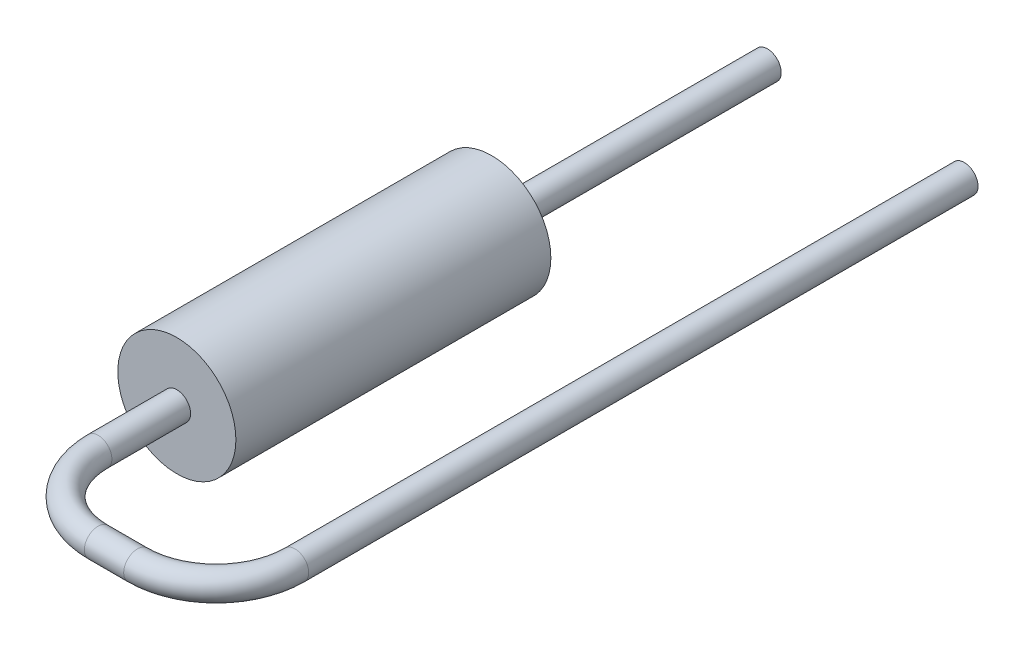
ISO-10303-21;
HEADER;
FILE_DESCRIPTION(('STEP AP214'),'2;1');
FILE_NAME('part.step','',(''),(''),'','','');
FILE_SCHEMA(('AUTOMOTIVE_DESIGN { 1 0 10303 214 1 1 1 1 }'));
ENDSEC;
DATA;
#1=APPLICATION_CONTEXT('core data for automotive mechanical design processes');
#2=APPLICATION_PROTOCOL_DEFINITION('international standard','automotive_design',2000,#1);
#3=PRODUCT_CONTEXT('',#1,'mechanical');
#4=PRODUCT('Part','Part','',(#3));
#5=PRODUCT_RELATED_PRODUCT_CATEGORY('part','',(#4));
#6=PRODUCT_DEFINITION_FORMATION('','',#4);
#7=PRODUCT_DEFINITION_CONTEXT('part definition',#1,'design');
#8=PRODUCT_DEFINITION('design','',#6,#7);
#9=PRODUCT_DEFINITION_SHAPE('','',#8);
#10=(LENGTH_UNIT() NAMED_UNIT(*) SI_UNIT(.MILLI.,.METRE.));
#11=(NAMED_UNIT(*) PLANE_ANGLE_UNIT() SI_UNIT($,.RADIAN.));
#12=(NAMED_UNIT(*) SI_UNIT($,.STERADIAN.) SOLID_ANGLE_UNIT());
#13=UNCERTAINTY_MEASURE_WITH_UNIT(LENGTH_MEASURE(1.E-05),#10,'distance_accuracy_value','');
#14=(GEOMETRIC_REPRESENTATION_CONTEXT(3) GLOBAL_UNCERTAINTY_ASSIGNED_CONTEXT((#13)) GLOBAL_UNIT_ASSIGNED_CONTEXT((#10,
#11,#12)) REPRESENTATION_CONTEXT('',''));
#15=CARTESIAN_POINT('',(0.,0.,0.));
#16=DIRECTION('',(0.,0.,1.));
#17=DIRECTION('',(1.,0.,0.));
#18=AXIS2_PLACEMENT_3D('',#15,#16,#17);
#19=CARTESIAN_POINT('',(0.,0.,0.));
#20=DIRECTION('',(0.,0.,1.));
#21=DIRECTION('',(1.,0.,0.));
#22=AXIS2_PLACEMENT_3D('',#19,#20,#21);
#23=PLANE('',#22);
#24=CARTESIAN_POINT('',(0.,0.,0.));
#25=DIRECTION('',(0.,0.,1.));
#26=DIRECTION('',(1.,0.,0.));
#27=AXIS2_PLACEMENT_3D('',#24,#25,#26);
#28=CIRCLE('',#27,1.5);
#29=CARTESIAN_POINT('',(1.5,0.,0.));
#30=VERTEX_POINT('',#29);
#31=EDGE_CURVE('E47',#30,#30,#28,.T.);
#32=ORIENTED_EDGE('',*,*,#31,.F.);
#33=EDGE_LOOP('',(#32));
#34=FACE_BOUND('',#33,.T.);
#35=CARTESIAN_POINT('',(0.,0.,0.));
#36=DIRECTION('',(0.,0.,1.));
#37=DIRECTION('',(1.,0.,0.));
#38=AXIS2_PLACEMENT_3D('',#35,#36,#37);
#39=CIRCLE('',#38,0.35);
#40=CARTESIAN_POINT('',(0.35,0.,0.));
#41=VERTEX_POINT('',#40);
#42=EDGE_CURVE('E10',#41,#41,#39,.F.);
#43=ORIENTED_EDGE('',*,*,#42,.F.);
#44=EDGE_LOOP('',(#43));
#45=FACE_BOUND('',#44,.T.);
#46=ADVANCED_FACE('F31',(#34,#45),#23,.F.);
#47=CARTESIAN_POINT('',(0.,0.,8.));
#48=DIRECTION('',(0.,0.,-1.));
#49=DIRECTION('',(-1.,0.,0.));
#50=AXIS2_PLACEMENT_3D('',#47,#48,#49);
#51=CYLINDRICAL_SURFACE('',#50,1.5);
#52=CARTESIAN_POINT('',(0.,0.,8.));
#53=DIRECTION('',(0.,0.,1.));
#54=DIRECTION('',(1.,0.,0.));
#55=AXIS2_PLACEMENT_3D('',#52,#53,#54);
#56=CIRCLE('',#55,1.5);
#57=CARTESIAN_POINT('',(1.5,0.,8.));
#58=VERTEX_POINT('',#57);
#59=EDGE_CURVE('E42',#58,#58,#56,.T.);
#60=ORIENTED_EDGE('',*,*,#59,.F.);
#61=EDGE_LOOP('',(#60));
#62=FACE_BOUND('',#61,.T.);
#63=ORIENTED_EDGE('',*,*,#31,.T.);
#64=EDGE_LOOP('',(#63));
#65=FACE_BOUND('',#64,.T.);
#66=ADVANCED_FACE('F33',(#62,#65),#51,.T.);
#67=CARTESIAN_POINT('',(0.,0.,8.));
#68=DIRECTION('',(0.,0.,1.));
#69=DIRECTION('',(1.,0.,0.));
#70=AXIS2_PLACEMENT_3D('',#67,#68,#69);
#71=PLANE('',#70);
#72=CARTESIAN_POINT('',(0.,0.,8.));
#73=DIRECTION('',(0.,0.,1.));
#74=DIRECTION('',(1.,0.,0.));
#75=AXIS2_PLACEMENT_3D('',#72,#73,#74);
#76=CIRCLE('',#75,0.35);
#77=CARTESIAN_POINT('',(0.35,0.,8.));
#78=VERTEX_POINT('',#77);
#79=EDGE_CURVE('E38',#78,#78,#76,.T.);
#80=ORIENTED_EDGE('',*,*,#79,.F.);
#81=EDGE_LOOP('',(#80));
#82=FACE_BOUND('',#81,.T.);
#83=ORIENTED_EDGE('',*,*,#59,.T.);
#84=EDGE_LOOP('',(#83));
#85=FACE_BOUND('',#84,.T.);
#86=ADVANCED_FACE('F73',(#82,#85),#71,.T.);
#87=CARTESIAN_POINT('',(5.,0.,9.99999999999999));
#88=DIRECTION('',(0.,0.,-1.));
#89=DIRECTION('',(-1.,0.,0.));
#90=AXIS2_PLACEMENT_3D('',#87,#88,#89);
#91=CYLINDRICAL_SURFACE('',#90,0.35);
#92=CARTESIAN_POINT('',(5.,0.,9.99999999999999));
#93=DIRECTION('',(0.,0.,-1.));
#94=DIRECTION('',(-1.,0.,0.));
#95=AXIS2_PLACEMENT_3D('',#92,#93,#94);
#96=CIRCLE('',#95,0.35);
#97=CARTESIAN_POINT('',(5.35,0.,9.99999999999998));
#98=VERTEX_POINT('',#97);
#99=EDGE_CURVE('E59',#98,#98,#96,.T.);
#100=ORIENTED_EDGE('',*,*,#99,.T.);
#101=EDGE_LOOP('',(#100));
#102=FACE_BOUND('',#101,.T.);
#103=CARTESIAN_POINT('',(5.,0.,-7.));
#104=DIRECTION('',(0.,0.,-1.));
#105=DIRECTION('',(-1.,0.,0.));
#106=AXIS2_PLACEMENT_3D('',#103,#104,#105);
#107=CIRCLE('',#106,0.35);
#108=CARTESIAN_POINT('',(4.65,0.,-6.99999999999999));
#109=VERTEX_POINT('',#108);
#110=EDGE_CURVE('E62',#109,#109,#107,.T.);
#111=ORIENTED_EDGE('',*,*,#110,.F.);
#112=EDGE_LOOP('',(#111));
#113=FACE_BOUND('',#112,.T.);
#114=ADVANCED_FACE('F78',(#102,#113),#91,.T.);
#115=CARTESIAN_POINT('',(3.,0.,10.));
#116=DIRECTION('',(0.,1.,0.));
#117=DIRECTION('',(0.,0.,1.));
#118=AXIS2_PLACEMENT_3D('',#115,#116,#117);
#119=TOROIDAL_SURFACE('',#118,2.,0.35);
#120=CARTESIAN_POINT('',(2.99999999999999,0.,12.));
#121=DIRECTION('',(1.,0.,0.));
#122=DIRECTION('',(0.,0.,-1.));
#123=AXIS2_PLACEMENT_3D('',#120,#121,#122);
#124=CIRCLE('',#123,0.35);
#125=CARTESIAN_POINT('',(2.99999999999998,0.,12.35));
#126=VERTEX_POINT('',#125);
#127=EDGE_CURVE('E56',#126,#126,#124,.T.);
#128=CARTESIAN_POINT('',(3.,0.,10.));
#129=DIRECTION('',(0.,1.,0.));
#130=DIRECTION('',(0.,0.,1.));
#131=AXIS2_PLACEMENT_3D('',#128,#129,#130);
#132=CIRCLE('',#131,2.35);
#133=EDGE_CURVE('',#126,#98,#132,.T.);
#134=ORIENTED_EDGE('',*,*,#127,.T.);
#135=ORIENTED_EDGE('',*,*,#99,.F.);
#136=ORIENTED_EDGE('',*,*,#133,.T.);
#137=ORIENTED_EDGE('',*,*,#133,.F.);
#138=EDGE_LOOP('',(#134,#136,#135,#137));
#139=FACE_BOUND('',#138,.T.);
#140=ADVANCED_FACE('F82',(#139),#119,.T.);
#141=CARTESIAN_POINT('',(2.00000000000001,0.,12.));
#142=DIRECTION('',(1.,0.,0.));
#143=DIRECTION('',(0.,0.,-1.));
#144=AXIS2_PLACEMENT_3D('',#141,#142,#143);
#145=CYLINDRICAL_SURFACE('',#144,0.35);
#146=CARTESIAN_POINT('',(2.00000000000001,0.,12.));
#147=DIRECTION('',(1.,0.,0.));
#148=DIRECTION('',(0.,0.,-1.));
#149=AXIS2_PLACEMENT_3D('',#146,#147,#148);
#150=CIRCLE('',#149,0.35);
#151=CARTESIAN_POINT('',(2.00000000000002,0.,12.35));
#152=VERTEX_POINT('',#151);
#153=EDGE_CURVE('E53',#152,#152,#150,.T.);
#154=ORIENTED_EDGE('',*,*,#153,.T.);
#155=EDGE_LOOP('',(#154));
#156=FACE_BOUND('',#155,.T.);
#157=ORIENTED_EDGE('',*,*,#127,.F.);
#158=EDGE_LOOP('',(#157));
#159=FACE_BOUND('',#158,.T.);
#160=ADVANCED_FACE('F86',(#156,#159),#145,.T.);
#161=CARTESIAN_POINT('',(2.,0.,10.));
#162=DIRECTION('',(0.,1.,0.));
#163=DIRECTION('',(0.,0.,1.));
#164=AXIS2_PLACEMENT_3D('',#161,#162,#163);
#165=TOROIDAL_SURFACE('',#164,2.,0.35);
#166=CARTESIAN_POINT('',(0.,0.,9.99999999999999));
#167=DIRECTION('',(0.,0.,1.));
#168=DIRECTION('',(1.,0.,0.));
#169=AXIS2_PLACEMENT_3D('',#166,#167,#168);
#170=CIRCLE('',#169,0.35);
#171=CARTESIAN_POINT('',(-0.35,0.,9.99999999999998));
#172=VERTEX_POINT('',#171);
#173=EDGE_CURVE('E51',#172,#172,#170,.T.);
#174=CARTESIAN_POINT('',(2.,0.,10.));
#175=DIRECTION('',(0.,1.,0.));
#176=DIRECTION('',(0.,0.,1.));
#177=AXIS2_PLACEMENT_3D('',#174,#175,#176);
#178=CIRCLE('',#177,2.35);
#179=EDGE_CURVE('',#172,#152,#178,.T.);
#180=ORIENTED_EDGE('',*,*,#173,.T.);
#181=ORIENTED_EDGE('',*,*,#153,.F.);
#182=ORIENTED_EDGE('',*,*,#179,.T.);
#183=ORIENTED_EDGE('',*,*,#179,.F.);
#184=EDGE_LOOP('',(#180,#182,#181,#183));
#185=FACE_BOUND('',#184,.T.);
#186=ADVANCED_FACE('F90',(#185),#165,.T.);
#187=CARTESIAN_POINT('',(0.,0.,9.99999999999999));
#188=DIRECTION('',(0.,0.,-1.));
#189=DIRECTION('',(-1.,0.,0.));
#190=AXIS2_PLACEMENT_3D('',#187,#188,#189);
#191=CYLINDRICAL_SURFACE('',#190,0.35);
#192=ORIENTED_EDGE('',*,*,#173,.F.);
#193=EDGE_LOOP('',(#192));
#194=FACE_BOUND('',#193,.T.);
#195=ORIENTED_EDGE('',*,*,#79,.T.);
#196=EDGE_LOOP('',(#195));
#197=FACE_BOUND('',#196,.T.);
#198=ADVANCED_FACE('F94',(#194,#197),#191,.T.);
#199=CARTESIAN_POINT('',(5.,0.,-7.));
#200=DIRECTION('',(0.,0.,-1.));
#201=DIRECTION('',(-1.,0.,0.));
#202=AXIS2_PLACEMENT_3D('',#199,#200,#201);
#203=PLANE('',#202);
#204=ORIENTED_EDGE('',*,*,#110,.T.);
#205=EDGE_LOOP('',(#204));
#206=FACE_BOUND('',#205,.T.);
#207=ADVANCED_FACE('F98',(#206),#203,.T.);
#208=CARTESIAN_POINT('',(0.,0.,-7.98994949366103));
#209=DIRECTION('',(0.,0.,1.));
#210=DIRECTION('',(1.,0.,0.));
#211=AXIS2_PLACEMENT_3D('',#208,#209,#210);
#212=CYLINDRICAL_SURFACE('',#211,0.35);
#213=ORIENTED_EDGE('',*,*,#42,.T.);
#214=EDGE_LOOP('',(#213));
#215=FACE_BOUND('',#214,.T.);
#216=CARTESIAN_POINT('',(0.,0.,-6.99999999999986));
#217=DIRECTION('',(0.,0.,-1.));
#218=DIRECTION('',(-1.,0.,0.));
#219=AXIS2_PLACEMENT_3D('',#216,#217,#218);
#220=CIRCLE('',#219,0.35);
#221=CARTESIAN_POINT('',(-0.35,0.,-6.99999999999985));
#222=VERTEX_POINT('',#221);
#223=EDGE_CURVE('E114',#222,#222,#220,.T.);
#224=ORIENTED_EDGE('',*,*,#223,.F.);
#225=EDGE_LOOP('',(#224));
#226=FACE_BOUND('',#225,.T.);
#227=ADVANCED_FACE('F102',(#215,#226),#212,.T.);
#228=CARTESIAN_POINT('',(5.,0.,-7.));
#229=DIRECTION('',(0.,0.,-1.));
#230=DIRECTION('',(-1.,0.,0.));
#231=AXIS2_PLACEMENT_3D('',#228,#229,#230);
#232=PLANE('',#231);
#233=ORIENTED_EDGE('',*,*,#223,.T.);
#234=EDGE_LOOP('',(#233));
#235=FACE_BOUND('',#234,.T.);
#236=ADVANCED_FACE('F104',(#235),#232,.T.);
#237=CLOSED_SHELL('',(#46,#66,#86,#114,#140,#160,#186,#198,#207,#227,#236));
#238=MANIFOLD_SOLID_BREP('B2',#237);
#239=ADVANCED_BREP_SHAPE_REPRESENTATION('',(#18,#238),#14);
#240=SHAPE_DEFINITION_REPRESENTATION(#9,#239);
ENDSEC;
END-ISO-10303-21;
